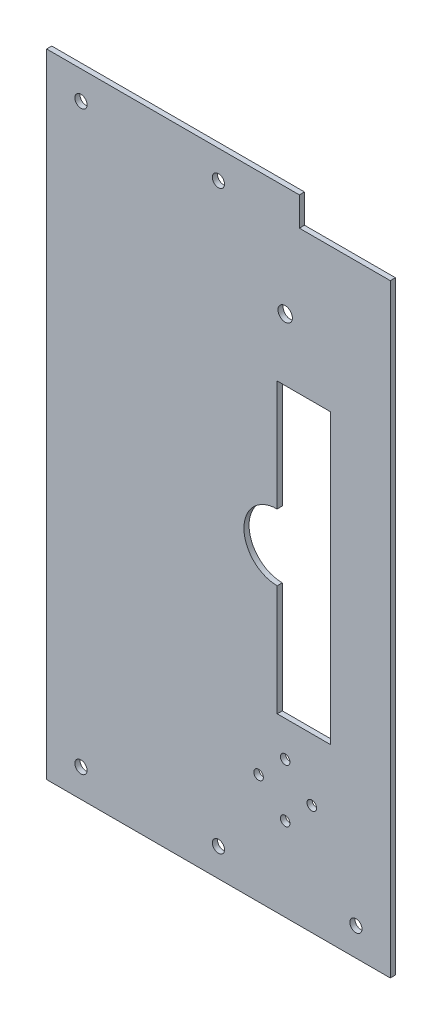
ISO-10303-21;
HEADER;
FILE_DESCRIPTION(('STEP AP214'),'2;1');
FILE_NAME('part.step','',(''),(''),'','','');
FILE_SCHEMA(('AUTOMOTIVE_DESIGN { 1 0 10303 214 1 1 1 1 }'));
ENDSEC;
DATA;
#1=APPLICATION_CONTEXT('core data for automotive mechanical design processes');
#2=APPLICATION_PROTOCOL_DEFINITION('international standard','automotive_design',2000,#1);
#3=PRODUCT_CONTEXT('',#1,'mechanical');
#4=PRODUCT('Part','Part','',(#3));
#5=PRODUCT_RELATED_PRODUCT_CATEGORY('part','',(#4));
#6=PRODUCT_DEFINITION_FORMATION('','',#4);
#7=PRODUCT_DEFINITION_CONTEXT('part definition',#1,'design');
#8=PRODUCT_DEFINITION('design','',#6,#7);
#9=PRODUCT_DEFINITION_SHAPE('','',#8);
#10=(LENGTH_UNIT() NAMED_UNIT(*) SI_UNIT(.MILLI.,.METRE.));
#11=(NAMED_UNIT(*) PLANE_ANGLE_UNIT() SI_UNIT($,.RADIAN.));
#12=(NAMED_UNIT(*) SI_UNIT($,.STERADIAN.) SOLID_ANGLE_UNIT());
#13=UNCERTAINTY_MEASURE_WITH_UNIT(LENGTH_MEASURE(1.E-05),#10,'distance_accuracy_value','');
#14=(GEOMETRIC_REPRESENTATION_CONTEXT(3) GLOBAL_UNCERTAINTY_ASSIGNED_CONTEXT((#13)) GLOBAL_UNIT_ASSIGNED_CONTEXT((#10,
#11,#12)) REPRESENTATION_CONTEXT('',''));
#15=CARTESIAN_POINT('',(0.,0.,0.));
#16=DIRECTION('',(0.,0.,1.));
#17=DIRECTION('',(1.,0.,0.));
#18=AXIS2_PLACEMENT_3D('',#15,#16,#17);
#19=CARTESIAN_POINT('',(77.5,142.695,2.305));
#20=DIRECTION('',(-1.,0.,0.));
#21=DIRECTION('',(0.,-1.,0.));
#22=AXIS2_PLACEMENT_3D('',#19,#20,#21);
#23=PLANE('',#22);
#24=DIRECTION('',(0.,1.,0.));
#25=VECTOR('',#24,1.);
#26=CARTESIAN_POINT('',(77.5,142.695,0.));
#27=LINE('',#26,#25);
#28=CARTESIAN_POINT('',(77.5,-142.695,0.));
#29=VERTEX_POINT('',#28);
#30=CARTESIAN_POINT('',(77.5,129.695,0.));
#31=VERTEX_POINT('',#30);
#32=EDGE_CURVE('E295',#29,#31,#27,.T.);
#33=ORIENTED_EDGE('',*,*,#32,.T.);
#34=DIRECTION('',(0.,0.,1.));
#35=VECTOR('',#34,1.);
#36=CARTESIAN_POINT('',(77.5,129.695,-7.695));
#37=LINE('',#36,#35);
#38=CARTESIAN_POINT('',(77.5,129.695,2.305));
#39=VERTEX_POINT('',#38);
#40=EDGE_CURVE('E206',#31,#39,#37,.T.);
#41=ORIENTED_EDGE('',*,*,#40,.T.);
#42=DIRECTION('',(0.,1.,0.));
#43=VECTOR('',#42,1.);
#44=CARTESIAN_POINT('',(77.5,142.695,2.305));
#45=LINE('',#44,#43);
#46=CARTESIAN_POINT('',(77.5,-142.695,2.305));
#47=VERTEX_POINT('',#46);
#48=EDGE_CURVE('E296',#47,#39,#45,.T.);
#49=ORIENTED_EDGE('',*,*,#48,.F.);
#50=DIRECTION('',(0.,0.,-1.));
#51=VECTOR('',#50,1.);
#52=CARTESIAN_POINT('',(77.5,-142.695,2.305));
#53=LINE('',#52,#51);
#54=EDGE_CURVE('E310',#47,#29,#53,.T.);
#55=ORIENTED_EDGE('',*,*,#54,.T.);
#56=EDGE_LOOP('',(#33,#41,#49,#55));
#57=FACE_BOUND('',#56,.T.);
#58=ADVANCED_FACE('F39',(#57),#23,.F.);
#59=CARTESIAN_POINT('',(-77.5,142.695,2.305));
#60=DIRECTION('',(0.,-1.,0.));
#61=DIRECTION('',(0.,0.,-1.));
#62=AXIS2_PLACEMENT_3D('',#59,#60,#61);
#63=PLANE('',#62);
#64=DIRECTION('',(-1.,0.,0.));
#65=VECTOR('',#64,1.);
#66=CARTESIAN_POINT('',(-77.5,142.695,2.305));
#67=LINE('',#66,#65);
#68=CARTESIAN_POINT('',(36.5,142.695,2.305));
#69=VERTEX_POINT('',#68);
#70=CARTESIAN_POINT('',(-77.5,142.695,2.305));
#71=VERTEX_POINT('',#70);
#72=EDGE_CURVE('E300',#69,#71,#67,.T.);
#73=ORIENTED_EDGE('',*,*,#72,.F.);
#74=DIRECTION('',(0.,0.,1.));
#75=VECTOR('',#74,1.);
#76=CARTESIAN_POINT('',(36.5,142.695,-7.695));
#77=LINE('',#76,#75);
#78=CARTESIAN_POINT('',(36.5,142.695,0.));
#79=VERTEX_POINT('',#78);
#80=EDGE_CURVE('E205',#79,#69,#77,.T.);
#81=ORIENTED_EDGE('',*,*,#80,.F.);
#82=DIRECTION('',(-1.,0.,0.));
#83=VECTOR('',#82,1.);
#84=CARTESIAN_POINT('',(-77.5,142.695,0.));
#85=LINE('',#84,#83);
#86=CARTESIAN_POINT('',(-77.5,142.695,0.));
#87=VERTEX_POINT('',#86);
#88=EDGE_CURVE('E314',#79,#87,#85,.T.);
#89=ORIENTED_EDGE('',*,*,#88,.T.);
#90=DIRECTION('',(0.,0.,-1.));
#91=VECTOR('',#90,1.);
#92=CARTESIAN_POINT('',(-77.5,142.695,2.305));
#93=LINE('',#92,#91);
#94=EDGE_CURVE('E329',#71,#87,#93,.T.);
#95=ORIENTED_EDGE('',*,*,#94,.F.);
#96=EDGE_LOOP('',(#73,#81,#89,#95));
#97=FACE_BOUND('',#96,.T.);
#98=ADVANCED_FACE('F345',(#97),#63,.F.);
#99=CARTESIAN_POINT('',(-77.5,142.695,2.305));
#100=DIRECTION('',(1.,0.,0.));
#101=DIRECTION('',(0.,1.,0.));
#102=AXIS2_PLACEMENT_3D('',#99,#100,#101);
#103=PLANE('',#102);
#104=DIRECTION('',(0.,-1.,0.));
#105=VECTOR('',#104,1.);
#106=CARTESIAN_POINT('',(-77.5,142.695,0.));
#107=LINE('',#106,#105);
#108=CARTESIAN_POINT('',(-77.5,-142.695,0.));
#109=VERTEX_POINT('',#108);
#110=EDGE_CURVE('E317',#87,#109,#107,.T.);
#111=ORIENTED_EDGE('',*,*,#110,.T.);
#112=DIRECTION('',(0.,0.,-1.));
#113=VECTOR('',#112,1.);
#114=CARTESIAN_POINT('',(-77.5,-142.695,2.305));
#115=LINE('',#114,#113);
#116=CARTESIAN_POINT('',(-77.5,-142.695,2.305));
#117=VERTEX_POINT('',#116);
#118=EDGE_CURVE('E325',#117,#109,#115,.T.);
#119=ORIENTED_EDGE('',*,*,#118,.F.);
#120=DIRECTION('',(0.,-1.,0.));
#121=VECTOR('',#120,1.);
#122=CARTESIAN_POINT('',(-77.5,142.695,2.305));
#123=LINE('',#122,#121);
#124=EDGE_CURVE('E304',#71,#117,#123,.T.);
#125=ORIENTED_EDGE('',*,*,#124,.F.);
#126=ORIENTED_EDGE('',*,*,#94,.T.);
#127=EDGE_LOOP('',(#111,#119,#125,#126));
#128=FACE_BOUND('',#127,.T.);
#129=ADVANCED_FACE('F363',(#128),#103,.F.);
#130=CARTESIAN_POINT('',(-77.5,-142.695,2.305));
#131=DIRECTION('',(0.,1.,0.));
#132=DIRECTION('',(0.,0.,1.));
#133=AXIS2_PLACEMENT_3D('',#130,#131,#132);
#134=PLANE('',#133);
#135=DIRECTION('',(1.,0.,0.));
#136=VECTOR('',#135,1.);
#137=CARTESIAN_POINT('',(-77.5,-142.695,0.));
#138=LINE('',#137,#136);
#139=EDGE_CURVE('E301',#109,#29,#138,.T.);
#140=ORIENTED_EDGE('',*,*,#139,.T.);
#141=ORIENTED_EDGE('',*,*,#54,.F.);
#142=DIRECTION('',(1.,0.,0.));
#143=VECTOR('',#142,1.);
#144=CARTESIAN_POINT('',(-77.5,-142.695,2.305));
#145=LINE('',#144,#143);
#146=EDGE_CURVE('E307',#117,#47,#145,.T.);
#147=ORIENTED_EDGE('',*,*,#146,.F.);
#148=ORIENTED_EDGE('',*,*,#118,.T.);
#149=EDGE_LOOP('',(#140,#141,#147,#148));
#150=FACE_BOUND('',#149,.T.);
#151=ADVANCED_FACE('F360',(#150),#134,.F.);
#152=CARTESIAN_POINT('',(0.,0.,2.305));
#153=DIRECTION('',(0.,0.,1.));
#154=DIRECTION('',(1.,0.,0.));
#155=AXIS2_PLACEMENT_3D('',#152,#153,#154);
#156=PLANE('',#155);
#157=DIRECTION('',(0.,-1.,0.));
#158=VECTOR('',#157,1.);
#159=CARTESIAN_POINT('',(26.5,65.,2.305));
#160=LINE('',#159,#158);
#161=CARTESIAN_POINT('',(26.5,65.,2.305));
#162=VERTEX_POINT('',#161);
#163=CARTESIAN_POINT('',(26.5,15.,2.305));
#164=VERTEX_POINT('',#163);
#165=EDGE_CURVE('E54',#162,#164,#160,.T.);
#166=ORIENTED_EDGE('',*,*,#165,.F.);
#167=DIRECTION('',(-1.,0.,0.));
#168=VECTOR('',#167,1.);
#169=CARTESIAN_POINT('',(26.5,65.,2.305));
#170=LINE('',#169,#168);
#171=CARTESIAN_POINT('',(50.5,65.,2.305));
#172=VERTEX_POINT('',#171);
#173=EDGE_CURVE('E150',#172,#162,#170,.T.);
#174=ORIENTED_EDGE('',*,*,#173,.F.);
#175=DIRECTION('',(0.,1.,0.));
#176=VECTOR('',#175,1.);
#177=CARTESIAN_POINT('',(50.5,65.,2.305));
#178=LINE('',#177,#176);
#179=CARTESIAN_POINT('',(50.5,-65.,2.305));
#180=VERTEX_POINT('',#179);
#181=EDGE_CURVE('E154',#180,#172,#178,.T.);
#182=ORIENTED_EDGE('',*,*,#181,.F.);
#183=DIRECTION('',(1.,0.,0.));
#184=VECTOR('',#183,1.);
#185=CARTESIAN_POINT('',(26.5,-65.,2.305));
#186=LINE('',#185,#184);
#187=CARTESIAN_POINT('',(26.5,-65.,2.305));
#188=VERTEX_POINT('',#187);
#189=EDGE_CURVE('E177',#188,#180,#186,.T.);
#190=ORIENTED_EDGE('',*,*,#189,.F.);
#191=DIRECTION('',(0.,-1.,0.));
#192=VECTOR('',#191,1.);
#193=CARTESIAN_POINT('',(26.5,-15.,2.305));
#194=LINE('',#193,#192);
#195=CARTESIAN_POINT('',(26.5,-15.,2.305));
#196=VERTEX_POINT('',#195);
#197=EDGE_CURVE('E173',#196,#188,#194,.T.);
#198=ORIENTED_EDGE('',*,*,#197,.F.);
#199=CARTESIAN_POINT('',(26.5,0.,2.305));
#200=DIRECTION('',(0.,0.,1.));
#201=DIRECTION('',(1.,0.,0.));
#202=AXIS2_PLACEMENT_3D('',#199,#200,#201);
#203=CIRCLE('',#202,15.);
#204=EDGE_CURVE('E170',#164,#196,#203,.T.);
#205=ORIENTED_EDGE('',*,*,#204,.F.);
#206=EDGE_LOOP('',(#166,#174,#182,#190,#198,#205));
#207=FACE_BOUND('',#206,.T.);
#208=DIRECTION('',(1.,0.,0.));
#209=VECTOR('',#208,1.);
#210=CARTESIAN_POINT('',(77.5,129.695,2.305));
#211=LINE('',#210,#209);
#212=CARTESIAN_POINT('',(36.5,129.695,2.305));
#213=VERTEX_POINT('',#212);
#214=EDGE_CURVE('E202',#213,#39,#211,.T.);
#215=ORIENTED_EDGE('',*,*,#214,.F.);
#216=DIRECTION('',(0.,-1.,0.));
#217=VECTOR('',#216,1.);
#218=CARTESIAN_POINT('',(36.5,142.695,2.305));
#219=LINE('',#218,#217);
#220=EDGE_CURVE('E187',#69,#213,#219,.T.);
#221=ORIENTED_EDGE('',*,*,#220,.F.);
#222=ORIENTED_EDGE('',*,*,#72,.T.);
#223=ORIENTED_EDGE('',*,*,#124,.T.);
#224=ORIENTED_EDGE('',*,*,#146,.T.);
#225=ORIENTED_EDGE('',*,*,#48,.T.);
#226=EDGE_LOOP('',(#215,#221,#222,#223,#224,#225));
#227=FACE_BOUND('',#226,.T.);
#228=CARTESIAN_POINT('',(42.1,-92.9999999999999,2.305));
#229=DIRECTION('',(0.,0.,1.));
#230=DIRECTION('',(1.,0.,0.));
#231=AXIS2_PLACEMENT_3D('',#228,#229,#230);
#232=CIRCLE('',#231,2.15);
#233=CARTESIAN_POINT('',(44.25,-92.9999999999999,2.305));
#234=VERTEX_POINT('',#233);
#235=EDGE_CURVE('E237',#234,#234,#232,.T.);
#236=ORIENTED_EDGE('',*,*,#235,.F.);
#237=EDGE_LOOP('',(#236));
#238=FACE_BOUND('',#237,.T.);
#239=CARTESIAN_POINT('',(30.1,-105.,2.305));
#240=DIRECTION('',(0.,0.,1.));
#241=DIRECTION('',(1.,0.,0.));
#242=AXIS2_PLACEMENT_3D('',#239,#240,#241);
#243=CIRCLE('',#242,2.15);
#244=CARTESIAN_POINT('',(32.25,-105.,2.305));
#245=VERTEX_POINT('',#244);
#246=EDGE_CURVE('E220',#245,#245,#243,.T.);
#247=ORIENTED_EDGE('',*,*,#246,.F.);
#248=EDGE_LOOP('',(#247));
#249=FACE_BOUND('',#248,.T.);
#250=CARTESIAN_POINT('',(18.1,-92.9999999999999,2.305));
#251=DIRECTION('',(0.,0.,1.));
#252=DIRECTION('',(1.,0.,0.));
#253=AXIS2_PLACEMENT_3D('',#250,#251,#252);
#254=CIRCLE('',#253,2.15);
#255=CARTESIAN_POINT('',(20.25,-92.9999999999999,2.305));
#256=VERTEX_POINT('',#255);
#257=EDGE_CURVE('E221',#256,#256,#254,.T.);
#258=ORIENTED_EDGE('',*,*,#257,.F.);
#259=EDGE_LOOP('',(#258));
#260=FACE_BOUND('',#259,.T.);
#261=CARTESIAN_POINT('',(30.1,93.,2.305));
#262=DIRECTION('',(0.,0.,1.));
#263=DIRECTION('',(1.,0.,0.));
#264=AXIS2_PLACEMENT_3D('',#261,#262,#263);
#265=CIRCLE('',#264,3.25);
#266=CARTESIAN_POINT('',(33.35,93.,2.305));
#267=VERTEX_POINT('',#266);
#268=EDGE_CURVE('E210',#267,#267,#265,.T.);
#269=ORIENTED_EDGE('',*,*,#268,.F.);
#270=EDGE_LOOP('',(#269));
#271=FACE_BOUND('',#270,.T.);
#272=CARTESIAN_POINT('',(30.1,-80.9999999999999,2.305));
#273=DIRECTION('',(0.,0.,1.));
#274=DIRECTION('',(1.,0.,0.));
#275=AXIS2_PLACEMENT_3D('',#272,#273,#274);
#276=CIRCLE('',#275,2.15);
#277=CARTESIAN_POINT('',(32.25,-80.9999999999999,2.305));
#278=VERTEX_POINT('',#277);
#279=EDGE_CURVE('E236',#278,#278,#276,.T.);
#280=ORIENTED_EDGE('',*,*,#279,.F.);
#281=EDGE_LOOP('',(#280));
#282=FACE_BOUND('',#281,.T.);
#283=CARTESIAN_POINT('',(-62.,129.995,2.305));
#284=DIRECTION('',(0.,0.,1.));
#285=DIRECTION('',(1.,0.,0.));
#286=AXIS2_PLACEMENT_3D('',#283,#284,#285);
#287=CIRCLE('',#286,2.74999999999999);
#288=CARTESIAN_POINT('',(-59.25,129.995,2.305));
#289=VERTEX_POINT('',#288);
#290=EDGE_CURVE('E252',#289,#289,#287,.T.);
#291=ORIENTED_EDGE('',*,*,#290,.F.);
#292=EDGE_LOOP('',(#291));
#293=FACE_BOUND('',#292,.T.);
#294=CARTESIAN_POINT('',(0.,129.995,2.305));
#295=DIRECTION('',(0.,0.,1.));
#296=DIRECTION('',(1.,0.,0.));
#297=AXIS2_PLACEMENT_3D('',#294,#295,#296);
#298=CIRCLE('',#297,2.74999999999999);
#299=CARTESIAN_POINT('',(2.74999999999999,129.995,2.305));
#300=VERTEX_POINT('',#299);
#301=EDGE_CURVE('E263',#300,#300,#298,.T.);
#302=ORIENTED_EDGE('',*,*,#301,.F.);
#303=EDGE_LOOP('',(#302));
#304=FACE_BOUND('',#303,.T.);
#305=CARTESIAN_POINT('',(-62.,-129.995,2.305));
#306=DIRECTION('',(0.,0.,1.));
#307=DIRECTION('',(1.,0.,0.));
#308=AXIS2_PLACEMENT_3D('',#305,#306,#307);
#309=CIRCLE('',#308,2.74999999999999);
#310=CARTESIAN_POINT('',(-59.25,-129.995,2.305));
#311=VERTEX_POINT('',#310);
#312=EDGE_CURVE('E271',#311,#311,#309,.T.);
#313=ORIENTED_EDGE('',*,*,#312,.F.);
#314=EDGE_LOOP('',(#313));
#315=FACE_BOUND('',#314,.T.);
#316=CARTESIAN_POINT('',(0.,-129.995,2.305));
#317=DIRECTION('',(0.,0.,1.));
#318=DIRECTION('',(1.,0.,0.));
#319=AXIS2_PLACEMENT_3D('',#316,#317,#318);
#320=CIRCLE('',#319,2.74999999999999);
#321=CARTESIAN_POINT('',(2.74999999999999,-129.995,2.305));
#322=VERTEX_POINT('',#321);
#323=EDGE_CURVE('E279',#322,#322,#320,.T.);
#324=ORIENTED_EDGE('',*,*,#323,.F.);
#325=EDGE_LOOP('',(#324));
#326=FACE_BOUND('',#325,.T.);
#327=CARTESIAN_POINT('',(62.,-129.995,2.305));
#328=DIRECTION('',(0.,0.,1.));
#329=DIRECTION('',(1.,0.,0.));
#330=AXIS2_PLACEMENT_3D('',#327,#328,#329);
#331=CIRCLE('',#330,2.74999999999999);
#332=CARTESIAN_POINT('',(64.75,-129.995,2.305));
#333=VERTEX_POINT('',#332);
#334=EDGE_CURVE('E287',#333,#333,#331,.T.);
#335=ORIENTED_EDGE('',*,*,#334,.F.);
#336=EDGE_LOOP('',(#335));
#337=FACE_BOUND('',#336,.T.);
#338=ADVANCED_FACE('F350',(#207,#227,#238,#249,#260,#271,#282,#293,#304,#315,#326,#337),#156,.T.);
#339=CARTESIAN_POINT('',(0.,0.,0.));
#340=DIRECTION('',(0.,0.,1.));
#341=DIRECTION('',(1.,0.,0.));
#342=AXIS2_PLACEMENT_3D('',#339,#340,#341);
#343=PLANE('',#342);
#344=DIRECTION('',(-1.,0.,0.));
#345=VECTOR('',#344,1.);
#346=CARTESIAN_POINT('',(26.5,65.,0.));
#347=LINE('',#346,#345);
#348=CARTESIAN_POINT('',(50.5,65.,0.));
#349=VERTEX_POINT('',#348);
#350=CARTESIAN_POINT('',(26.5,65.,0.));
#351=VERTEX_POINT('',#350);
#352=EDGE_CURVE('E137',#349,#351,#347,.T.);
#353=ORIENTED_EDGE('',*,*,#352,.T.);
#354=DIRECTION('',(0.,-1.,0.));
#355=VECTOR('',#354,1.);
#356=CARTESIAN_POINT('',(26.5,65.,0.));
#357=LINE('',#356,#355);
#358=CARTESIAN_POINT('',(26.5,15.,0.));
#359=VERTEX_POINT('',#358);
#360=EDGE_CURVE('E130',#351,#359,#357,.T.);
#361=ORIENTED_EDGE('',*,*,#360,.T.);
#362=CARTESIAN_POINT('',(26.5,0.,0.));
#363=DIRECTION('',(0.,0.,1.));
#364=DIRECTION('',(1.,0.,0.));
#365=AXIS2_PLACEMENT_3D('',#362,#363,#364);
#366=CIRCLE('',#365,15.);
#367=CARTESIAN_POINT('',(26.5,-15.,0.));
#368=VERTEX_POINT('',#367);
#369=EDGE_CURVE('E140',#359,#368,#366,.T.);
#370=ORIENTED_EDGE('',*,*,#369,.T.);
#371=DIRECTION('',(0.,-1.,0.));
#372=VECTOR('',#371,1.);
#373=CARTESIAN_POINT('',(26.5,-15.,0.));
#374=LINE('',#373,#372);
#375=CARTESIAN_POINT('',(26.5,-65.,0.));
#376=VERTEX_POINT('',#375);
#377=EDGE_CURVE('E62',#368,#376,#374,.T.);
#378=ORIENTED_EDGE('',*,*,#377,.T.);
#379=DIRECTION('',(1.,0.,0.));
#380=VECTOR('',#379,1.);
#381=CARTESIAN_POINT('',(26.5,-65.,0.));
#382=LINE('',#381,#380);
#383=CARTESIAN_POINT('',(50.5,-65.,0.));
#384=VERTEX_POINT('',#383);
#385=EDGE_CURVE('E159',#376,#384,#382,.T.);
#386=ORIENTED_EDGE('',*,*,#385,.T.);
#387=DIRECTION('',(0.,1.,0.));
#388=VECTOR('',#387,1.);
#389=CARTESIAN_POINT('',(50.5,65.,0.));
#390=LINE('',#389,#388);
#391=EDGE_CURVE('E163',#384,#349,#390,.T.);
#392=ORIENTED_EDGE('',*,*,#391,.T.);
#393=EDGE_LOOP('',(#353,#361,#370,#378,#386,#392));
#394=FACE_BOUND('',#393,.T.);
#395=CARTESIAN_POINT('',(42.1,-92.9999999999999,0.));
#396=DIRECTION('',(0.,0.,1.));
#397=DIRECTION('',(1.,0.,0.));
#398=AXIS2_PLACEMENT_3D('',#395,#396,#397);
#399=CIRCLE('',#398,2.15);
#400=CARTESIAN_POINT('',(44.25,-92.9999999999999,0.));
#401=VERTEX_POINT('',#400);
#402=EDGE_CURVE('E232',#401,#401,#399,.T.);
#403=ORIENTED_EDGE('',*,*,#402,.T.);
#404=EDGE_LOOP('',(#403));
#405=FACE_BOUND('',#404,.T.);
#406=CARTESIAN_POINT('',(30.1,-105.,0.));
#407=DIRECTION('',(0.,0.,1.));
#408=DIRECTION('',(1.,0.,0.));
#409=AXIS2_PLACEMENT_3D('',#406,#407,#408);
#410=CIRCLE('',#409,2.15);
#411=CARTESIAN_POINT('',(32.25,-105.,0.));
#412=VERTEX_POINT('',#411);
#413=EDGE_CURVE('E241',#412,#412,#410,.T.);
#414=ORIENTED_EDGE('',*,*,#413,.T.);
#415=EDGE_LOOP('',(#414));
#416=FACE_BOUND('',#415,.T.);
#417=CARTESIAN_POINT('',(18.1,-92.9999999999999,0.));
#418=DIRECTION('',(0.,0.,1.));
#419=DIRECTION('',(1.,0.,0.));
#420=AXIS2_PLACEMENT_3D('',#417,#418,#419);
#421=CIRCLE('',#420,2.15);
#422=CARTESIAN_POINT('',(20.25,-92.9999999999999,0.));
#423=VERTEX_POINT('',#422);
#424=EDGE_CURVE('E216',#423,#423,#421,.T.);
#425=ORIENTED_EDGE('',*,*,#424,.T.);
#426=EDGE_LOOP('',(#425));
#427=FACE_BOUND('',#426,.T.);
#428=CARTESIAN_POINT('',(30.1,93.,0.));
#429=DIRECTION('',(0.,0.,1.));
#430=DIRECTION('',(1.,0.,0.));
#431=AXIS2_PLACEMENT_3D('',#428,#429,#430);
#432=CIRCLE('',#431,3.25);
#433=CARTESIAN_POINT('',(33.35,93.,0.));
#434=VERTEX_POINT('',#433);
#435=EDGE_CURVE('E225',#434,#434,#432,.T.);
#436=ORIENTED_EDGE('',*,*,#435,.T.);
#437=EDGE_LOOP('',(#436));
#438=FACE_BOUND('',#437,.T.);
#439=CARTESIAN_POINT('',(30.1,-80.9999999999999,0.));
#440=DIRECTION('',(0.,0.,1.));
#441=DIRECTION('',(1.,0.,0.));
#442=AXIS2_PLACEMENT_3D('',#439,#440,#441);
#443=CIRCLE('',#442,2.15);
#444=CARTESIAN_POINT('',(32.25,-80.9999999999999,0.));
#445=VERTEX_POINT('',#444);
#446=EDGE_CURVE('E248',#445,#445,#443,.T.);
#447=ORIENTED_EDGE('',*,*,#446,.T.);
#448=EDGE_LOOP('',(#447));
#449=FACE_BOUND('',#448,.T.);
#450=CARTESIAN_POINT('',(-62.,129.995,0.));
#451=DIRECTION('',(0.,0.,1.));
#452=DIRECTION('',(1.,0.,0.));
#453=AXIS2_PLACEMENT_3D('',#450,#451,#452);
#454=CIRCLE('',#453,2.75);
#455=CARTESIAN_POINT('',(-59.25,129.995,0.));
#456=VERTEX_POINT('',#455);
#457=EDGE_CURVE('E259',#456,#456,#454,.T.);
#458=ORIENTED_EDGE('',*,*,#457,.T.);
#459=EDGE_LOOP('',(#458));
#460=FACE_BOUND('',#459,.T.);
#461=CARTESIAN_POINT('',(0.,129.995,0.));
#462=DIRECTION('',(0.,0.,1.));
#463=DIRECTION('',(1.,0.,0.));
#464=AXIS2_PLACEMENT_3D('',#461,#462,#463);
#465=CIRCLE('',#464,2.75);
#466=CARTESIAN_POINT('',(2.75,129.995,0.));
#467=VERTEX_POINT('',#466);
#468=EDGE_CURVE('E267',#467,#467,#465,.T.);
#469=ORIENTED_EDGE('',*,*,#468,.T.);
#470=EDGE_LOOP('',(#469));
#471=FACE_BOUND('',#470,.T.);
#472=CARTESIAN_POINT('',(-62.,-129.995,0.));
#473=DIRECTION('',(0.,0.,1.));
#474=DIRECTION('',(1.,0.,0.));
#475=AXIS2_PLACEMENT_3D('',#472,#473,#474);
#476=CIRCLE('',#475,2.75);
#477=CARTESIAN_POINT('',(-59.25,-129.995,0.));
#478=VERTEX_POINT('',#477);
#479=EDGE_CURVE('E275',#478,#478,#476,.T.);
#480=ORIENTED_EDGE('',*,*,#479,.T.);
#481=EDGE_LOOP('',(#480));
#482=FACE_BOUND('',#481,.T.);
#483=CARTESIAN_POINT('',(0.,-129.995,0.));
#484=DIRECTION('',(0.,0.,1.));
#485=DIRECTION('',(1.,0.,0.));
#486=AXIS2_PLACEMENT_3D('',#483,#484,#485);
#487=CIRCLE('',#486,2.75);
#488=CARTESIAN_POINT('',(2.75,-129.995,0.));
#489=VERTEX_POINT('',#488);
#490=EDGE_CURVE('E283',#489,#489,#487,.T.);
#491=ORIENTED_EDGE('',*,*,#490,.T.);
#492=EDGE_LOOP('',(#491));
#493=FACE_BOUND('',#492,.T.);
#494=CARTESIAN_POINT('',(62.,-129.995,0.));
#495=DIRECTION('',(0.,0.,1.));
#496=DIRECTION('',(1.,0.,0.));
#497=AXIS2_PLACEMENT_3D('',#494,#495,#496);
#498=CIRCLE('',#497,2.75);
#499=CARTESIAN_POINT('',(64.75,-129.995,0.));
#500=VERTEX_POINT('',#499);
#501=EDGE_CURVE('E291',#500,#500,#498,.T.);
#502=ORIENTED_EDGE('',*,*,#501,.T.);
#503=EDGE_LOOP('',(#502));
#504=FACE_BOUND('',#503,.T.);
#505=DIRECTION('',(0.,-1.,0.));
#506=VECTOR('',#505,1.);
#507=CARTESIAN_POINT('',(36.4999999999998,0.,0.));
#508=LINE('',#507,#506);
#509=CARTESIAN_POINT('',(36.5,129.695,0.));
#510=VERTEX_POINT('',#509);
#511=EDGE_CURVE('E47',#79,#510,#508,.T.);
#512=ORIENTED_EDGE('',*,*,#511,.T.);
#513=DIRECTION('',(1.,0.,0.));
#514=VECTOR('',#513,1.);
#515=CARTESIAN_POINT('',(0.,129.695,0.));
#516=LINE('',#515,#514);
#517=EDGE_CURVE('E11',#510,#31,#516,.T.);
#518=ORIENTED_EDGE('',*,*,#517,.T.);
#519=ORIENTED_EDGE('',*,*,#32,.F.);
#520=ORIENTED_EDGE('',*,*,#139,.F.);
#521=ORIENTED_EDGE('',*,*,#110,.F.);
#522=ORIENTED_EDGE('',*,*,#88,.F.);
#523=EDGE_LOOP('',(#512,#518,#519,#520,#521,#522));
#524=FACE_BOUND('',#523,.T.);
#525=ADVANCED_FACE('F145',(#394,#405,#416,#427,#438,#449,#460,#471,#482,#493,#504,#524),#343,.F.);
#526=CARTESIAN_POINT('',(62.,-129.995,2.305));
#527=DIRECTION('',(0.,0.,1.));
#528=DIRECTION('',(1.,0.,0.));
#529=AXIS2_PLACEMENT_3D('',#526,#527,#528);
#530=CYLINDRICAL_SURFACE('',#529,2.75);
#531=ORIENTED_EDGE('',*,*,#501,.F.);
#532=EDGE_LOOP('',(#531));
#533=FACE_BOUND('',#532,.T.);
#534=ORIENTED_EDGE('',*,*,#334,.T.);
#535=EDGE_LOOP('',(#534));
#536=FACE_BOUND('',#535,.T.);
#537=ADVANCED_FACE('F420',(#533,#536),#530,.F.);
#538=CARTESIAN_POINT('',(0.,-129.995,2.305));
#539=DIRECTION('',(0.,0.,1.));
#540=DIRECTION('',(1.,0.,0.));
#541=AXIS2_PLACEMENT_3D('',#538,#539,#540);
#542=CYLINDRICAL_SURFACE('',#541,2.74999999999999);
#543=ORIENTED_EDGE('',*,*,#490,.F.);
#544=EDGE_LOOP('',(#543));
#545=FACE_BOUND('',#544,.T.);
#546=ORIENTED_EDGE('',*,*,#323,.T.);
#547=EDGE_LOOP('',(#546));
#548=FACE_BOUND('',#547,.T.);
#549=ADVANCED_FACE('F509',(#545,#548),#542,.F.);
#550=CARTESIAN_POINT('',(-62.,-129.995,2.305));
#551=DIRECTION('',(0.,0.,1.));
#552=DIRECTION('',(1.,0.,0.));
#553=AXIS2_PLACEMENT_3D('',#550,#551,#552);
#554=CYLINDRICAL_SURFACE('',#553,2.75);
#555=ORIENTED_EDGE('',*,*,#479,.F.);
#556=EDGE_LOOP('',(#555));
#557=FACE_BOUND('',#556,.T.);
#558=ORIENTED_EDGE('',*,*,#312,.T.);
#559=EDGE_LOOP('',(#558));
#560=FACE_BOUND('',#559,.T.);
#561=ADVANCED_FACE('F505',(#557,#560),#554,.F.);
#562=CARTESIAN_POINT('',(0.,129.995,2.305));
#563=DIRECTION('',(0.,0.,1.));
#564=DIRECTION('',(1.,0.,0.));
#565=AXIS2_PLACEMENT_3D('',#562,#563,#564);
#566=CYLINDRICAL_SURFACE('',#565,2.74999999999999);
#567=ORIENTED_EDGE('',*,*,#468,.F.);
#568=EDGE_LOOP('',(#567));
#569=FACE_BOUND('',#568,.T.);
#570=ORIENTED_EDGE('',*,*,#301,.T.);
#571=EDGE_LOOP('',(#570));
#572=FACE_BOUND('',#571,.T.);
#573=ADVANCED_FACE('F501',(#569,#572),#566,.F.);
#574=CARTESIAN_POINT('',(-62.,129.995,2.305));
#575=DIRECTION('',(0.,0.,1.));
#576=DIRECTION('',(1.,0.,0.));
#577=AXIS2_PLACEMENT_3D('',#574,#575,#576);
#578=CYLINDRICAL_SURFACE('',#577,2.75);
#579=ORIENTED_EDGE('',*,*,#457,.F.);
#580=EDGE_LOOP('',(#579));
#581=FACE_BOUND('',#580,.T.);
#582=ORIENTED_EDGE('',*,*,#290,.T.);
#583=EDGE_LOOP('',(#582));
#584=FACE_BOUND('',#583,.T.);
#585=ADVANCED_FACE('F497',(#581,#584),#578,.F.);
#586=CARTESIAN_POINT('',(30.1,-80.9999999999999,0.));
#587=DIRECTION('',(0.,0.,1.));
#588=DIRECTION('',(1.,0.,0.));
#589=AXIS2_PLACEMENT_3D('',#586,#587,#588);
#590=CYLINDRICAL_SURFACE('',#589,2.15);
#591=ORIENTED_EDGE('',*,*,#446,.F.);
#592=EDGE_LOOP('',(#591));
#593=FACE_BOUND('',#592,.T.);
#594=ORIENTED_EDGE('',*,*,#279,.T.);
#595=EDGE_LOOP('',(#594));
#596=FACE_BOUND('',#595,.T.);
#597=ADVANCED_FACE('F488',(#593,#596),#590,.F.);
#598=CARTESIAN_POINT('',(30.1,93.,0.));
#599=DIRECTION('',(0.,0.,1.));
#600=DIRECTION('',(1.,0.,0.));
#601=AXIS2_PLACEMENT_3D('',#598,#599,#600);
#602=CYLINDRICAL_SURFACE('',#601,3.25);
#603=ORIENTED_EDGE('',*,*,#435,.F.);
#604=EDGE_LOOP('',(#603));
#605=FACE_BOUND('',#604,.T.);
#606=ORIENTED_EDGE('',*,*,#268,.T.);
#607=EDGE_LOOP('',(#606));
#608=FACE_BOUND('',#607,.T.);
#609=ADVANCED_FACE('F484',(#605,#608),#602,.F.);
#610=CARTESIAN_POINT('',(18.1,-92.9999999999999,0.));
#611=DIRECTION('',(0.,0.,1.));
#612=DIRECTION('',(1.,0.,0.));
#613=AXIS2_PLACEMENT_3D('',#610,#611,#612);
#614=CYLINDRICAL_SURFACE('',#613,2.15);
#615=ORIENTED_EDGE('',*,*,#424,.F.);
#616=EDGE_LOOP('',(#615));
#617=FACE_BOUND('',#616,.T.);
#618=ORIENTED_EDGE('',*,*,#257,.T.);
#619=EDGE_LOOP('',(#618));
#620=FACE_BOUND('',#619,.T.);
#621=ADVANCED_FACE('F480',(#617,#620),#614,.F.);
#622=CARTESIAN_POINT('',(30.1,-105.,0.));
#623=DIRECTION('',(0.,0.,1.));
#624=DIRECTION('',(1.,0.,0.));
#625=AXIS2_PLACEMENT_3D('',#622,#623,#624);
#626=CYLINDRICAL_SURFACE('',#625,2.15);
#627=ORIENTED_EDGE('',*,*,#413,.F.);
#628=EDGE_LOOP('',(#627));
#629=FACE_BOUND('',#628,.T.);
#630=ORIENTED_EDGE('',*,*,#246,.T.);
#631=EDGE_LOOP('',(#630));
#632=FACE_BOUND('',#631,.T.);
#633=ADVANCED_FACE('F483',(#629,#632),#626,.F.);
#634=CARTESIAN_POINT('',(42.1,-92.9999999999999,0.));
#635=DIRECTION('',(0.,0.,1.));
#636=DIRECTION('',(1.,0.,0.));
#637=AXIS2_PLACEMENT_3D('',#634,#635,#636);
#638=CYLINDRICAL_SURFACE('',#637,2.15);
#639=ORIENTED_EDGE('',*,*,#402,.F.);
#640=EDGE_LOOP('',(#639));
#641=FACE_BOUND('',#640,.T.);
#642=ORIENTED_EDGE('',*,*,#235,.T.);
#643=EDGE_LOOP('',(#642));
#644=FACE_BOUND('',#643,.T.);
#645=ADVANCED_FACE('F389',(#641,#644),#638,.F.);
#646=CARTESIAN_POINT('',(77.5,129.695,-7.695));
#647=DIRECTION('',(0.,-1.,0.));
#648=DIRECTION('',(0.,0.,-1.));
#649=AXIS2_PLACEMENT_3D('',#646,#647,#648);
#650=PLANE('',#649);
#651=DIRECTION('',(0.,0.,1.));
#652=VECTOR('',#651,1.);
#653=CARTESIAN_POINT('',(36.5,129.695,-7.695));
#654=LINE('',#653,#652);
#655=EDGE_CURVE('E211',#510,#213,#654,.T.);
#656=ORIENTED_EDGE('',*,*,#655,.T.);
#657=ORIENTED_EDGE('',*,*,#214,.T.);
#658=ORIENTED_EDGE('',*,*,#40,.F.);
#659=ORIENTED_EDGE('',*,*,#517,.F.);
#660=EDGE_LOOP('',(#656,#657,#658,#659));
#661=FACE_BOUND('',#660,.T.);
#662=ADVANCED_FACE('F355',(#661),#650,.F.);
#663=CARTESIAN_POINT('',(36.5,142.695,-7.695));
#664=DIRECTION('',(-1.,0.,0.));
#665=DIRECTION('',(0.,-1.,0.));
#666=AXIS2_PLACEMENT_3D('',#663,#664,#665);
#667=PLANE('',#666);
#668=ORIENTED_EDGE('',*,*,#80,.T.);
#669=ORIENTED_EDGE('',*,*,#220,.T.);
#670=ORIENTED_EDGE('',*,*,#655,.F.);
#671=ORIENTED_EDGE('',*,*,#511,.F.);
#672=EDGE_LOOP('',(#668,#669,#670,#671));
#673=FACE_BOUND('',#672,.T.);
#674=ADVANCED_FACE('F341',(#673),#667,.F.);
#675=CARTESIAN_POINT('',(26.5,65.,0.));
#676=DIRECTION('',(-1.,0.,0.));
#677=DIRECTION('',(0.,-1.,0.));
#678=AXIS2_PLACEMENT_3D('',#675,#676,#677);
#679=PLANE('',#678);
#680=ORIENTED_EDGE('',*,*,#165,.T.);
#681=DIRECTION('',(0.,0.,1.));
#682=VECTOR('',#681,1.);
#683=CARTESIAN_POINT('',(26.5,15.,0.));
#684=LINE('',#683,#682);
#685=EDGE_CURVE('E126',#359,#164,#684,.T.);
#686=ORIENTED_EDGE('',*,*,#685,.F.);
#687=ORIENTED_EDGE('',*,*,#360,.F.);
#688=DIRECTION('',(0.,0.,1.));
#689=VECTOR('',#688,1.);
#690=CARTESIAN_POINT('',(26.5,65.,0.));
#691=LINE('',#690,#689);
#692=EDGE_CURVE('E184',#351,#162,#691,.T.);
#693=ORIENTED_EDGE('',*,*,#692,.T.);
#694=EDGE_LOOP('',(#680,#686,#687,#693));
#695=FACE_BOUND('',#694,.T.);
#696=ADVANCED_FACE('F128',(#695),#679,.F.);
#697=CARTESIAN_POINT('',(26.5,65.,0.));
#698=DIRECTION('',(0.,1.,0.));
#699=DIRECTION('',(0.,0.,1.));
#700=AXIS2_PLACEMENT_3D('',#697,#698,#699);
#701=PLANE('',#700);
#702=ORIENTED_EDGE('',*,*,#173,.T.);
#703=ORIENTED_EDGE('',*,*,#692,.F.);
#704=ORIENTED_EDGE('',*,*,#352,.F.);
#705=DIRECTION('',(0.,0.,1.));
#706=VECTOR('',#705,1.);
#707=CARTESIAN_POINT('',(50.5,65.,0.));
#708=LINE('',#707,#706);
#709=EDGE_CURVE('E188',#349,#172,#708,.T.);
#710=ORIENTED_EDGE('',*,*,#709,.T.);
#711=EDGE_LOOP('',(#702,#703,#704,#710));
#712=FACE_BOUND('',#711,.T.);
#713=ADVANCED_FACE('F429',(#712),#701,.F.);
#714=CARTESIAN_POINT('',(50.5,65.,0.));
#715=DIRECTION('',(1.,0.,0.));
#716=DIRECTION('',(0.,1.,0.));
#717=AXIS2_PLACEMENT_3D('',#714,#715,#716);
#718=PLANE('',#717);
#719=ORIENTED_EDGE('',*,*,#181,.T.);
#720=ORIENTED_EDGE('',*,*,#709,.F.);
#721=ORIENTED_EDGE('',*,*,#391,.F.);
#722=DIRECTION('',(0.,0.,1.));
#723=VECTOR('',#722,1.);
#724=CARTESIAN_POINT('',(50.5,-65.,0.));
#725=LINE('',#724,#723);
#726=EDGE_CURVE('E191',#384,#180,#725,.T.);
#727=ORIENTED_EDGE('',*,*,#726,.T.);
#728=EDGE_LOOP('',(#719,#720,#721,#727));
#729=FACE_BOUND('',#728,.T.);
#730=ADVANCED_FACE('F438',(#729),#718,.F.);
#731=CARTESIAN_POINT('',(26.5,-65.,0.));
#732=DIRECTION('',(0.,-1.,0.));
#733=DIRECTION('',(0.,0.,-1.));
#734=AXIS2_PLACEMENT_3D('',#731,#732,#733);
#735=PLANE('',#734);
#736=ORIENTED_EDGE('',*,*,#189,.T.);
#737=ORIENTED_EDGE('',*,*,#726,.F.);
#738=ORIENTED_EDGE('',*,*,#385,.F.);
#739=DIRECTION('',(0.,0.,1.));
#740=VECTOR('',#739,1.);
#741=CARTESIAN_POINT('',(26.5,-65.,0.));
#742=LINE('',#741,#740);
#743=EDGE_CURVE('E194',#376,#188,#742,.T.);
#744=ORIENTED_EDGE('',*,*,#743,.T.);
#745=EDGE_LOOP('',(#736,#737,#738,#744));
#746=FACE_BOUND('',#745,.T.);
#747=ADVANCED_FACE('F448',(#746),#735,.F.);
#748=CARTESIAN_POINT('',(26.5,-15.,0.));
#749=DIRECTION('',(-1.,0.,0.));
#750=DIRECTION('',(0.,-1.,0.));
#751=AXIS2_PLACEMENT_3D('',#748,#749,#750);
#752=PLANE('',#751);
#753=ORIENTED_EDGE('',*,*,#197,.T.);
#754=ORIENTED_EDGE('',*,*,#743,.F.);
#755=ORIENTED_EDGE('',*,*,#377,.F.);
#756=DIRECTION('',(0.,0.,1.));
#757=VECTOR('',#756,1.);
#758=CARTESIAN_POINT('',(26.5,-15.,0.));
#759=LINE('',#758,#757);
#760=EDGE_CURVE('E136',#368,#196,#759,.T.);
#761=ORIENTED_EDGE('',*,*,#760,.T.);
#762=EDGE_LOOP('',(#753,#754,#755,#761));
#763=FACE_BOUND('',#762,.T.);
#764=ADVANCED_FACE('F458',(#763),#752,.F.);
#765=CARTESIAN_POINT('',(26.5,0.,0.));
#766=DIRECTION('',(0.,0.,1.));
#767=DIRECTION('',(1.,0.,0.));
#768=AXIS2_PLACEMENT_3D('',#765,#766,#767);
#769=CYLINDRICAL_SURFACE('',#768,15.);
#770=ORIENTED_EDGE('',*,*,#204,.T.);
#771=ORIENTED_EDGE('',*,*,#760,.F.);
#772=ORIENTED_EDGE('',*,*,#369,.F.);
#773=ORIENTED_EDGE('',*,*,#685,.T.);
#774=EDGE_LOOP('',(#770,#771,#772,#773));
#775=FACE_BOUND('',#774,.T.);
#776=ADVANCED_FACE('F141',(#775),#769,.F.);
#777=CLOSED_SHELL('',(#58,#98,#129,#151,#338,#525,#537,#549,#561,#573,#585,#597,#609,#621,#633,
#645,#662,#674,#696,#713,#730,#747,#764,#776));
#778=MANIFOLD_SOLID_BREP('B2',#777);
#779=ADVANCED_BREP_SHAPE_REPRESENTATION('',(#18,#778),#14);
#780=SHAPE_DEFINITION_REPRESENTATION(#9,#779);
ENDSEC;
END-ISO-10303-21;
